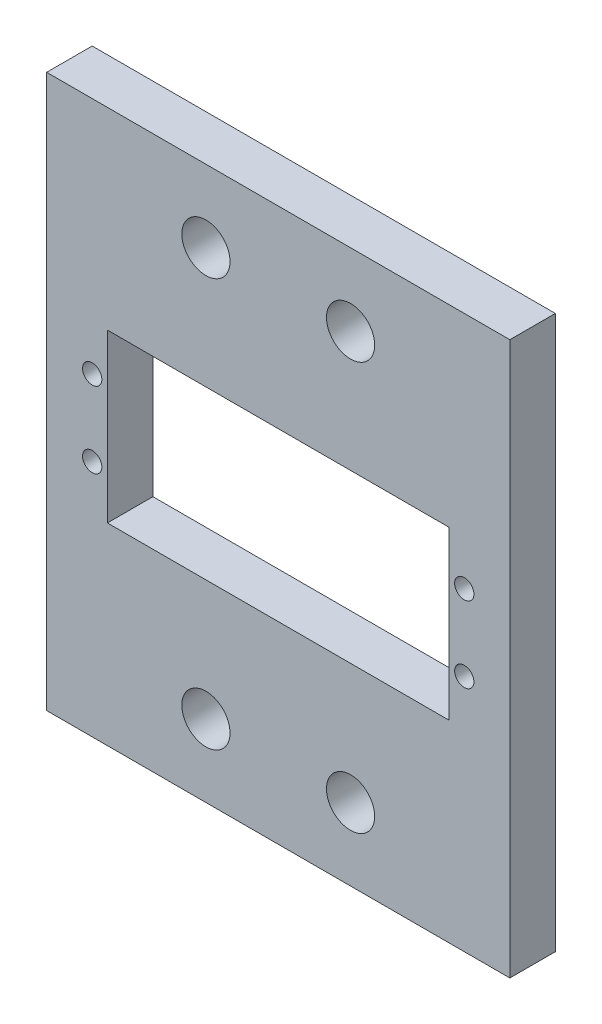
ISO-10303-21;
HEADER;
FILE_DESCRIPTION(('STEP AP214'),'2;1');
FILE_NAME('part.step','',(''),(''),'','','');
FILE_SCHEMA(('AUTOMOTIVE_DESIGN { 1 0 10303 214 1 1 1 1 }'));
ENDSEC;
DATA;
#1=APPLICATION_CONTEXT('core data for automotive mechanical design processes');
#2=APPLICATION_PROTOCOL_DEFINITION('international standard','automotive_design',2000,#1);
#3=PRODUCT_CONTEXT('',#1,'mechanical');
#4=PRODUCT('Part','Part','',(#3));
#5=PRODUCT_RELATED_PRODUCT_CATEGORY('part','',(#4));
#6=PRODUCT_DEFINITION_FORMATION('','',#4);
#7=PRODUCT_DEFINITION_CONTEXT('part definition',#1,'design');
#8=PRODUCT_DEFINITION('design','',#6,#7);
#9=PRODUCT_DEFINITION_SHAPE('','',#8);
#10=(LENGTH_UNIT() NAMED_UNIT(*) SI_UNIT(.MILLI.,.METRE.));
#11=(NAMED_UNIT(*) PLANE_ANGLE_UNIT() SI_UNIT($,.RADIAN.));
#12=(NAMED_UNIT(*) SI_UNIT($,.STERADIAN.) SOLID_ANGLE_UNIT());
#13=UNCERTAINTY_MEASURE_WITH_UNIT(LENGTH_MEASURE(1.E-05),#10,'distance_accuracy_value','');
#14=(GEOMETRIC_REPRESENTATION_CONTEXT(3) GLOBAL_UNCERTAINTY_ASSIGNED_CONTEXT((#13)) GLOBAL_UNIT_ASSIGNED_CONTEXT((#10,
#11,#12)) REPRESENTATION_CONTEXT('',''));
#15=CARTESIAN_POINT('',(0.,0.,0.));
#16=DIRECTION('',(0.,0.,1.));
#17=DIRECTION('',(1.,0.,0.));
#18=AXIS2_PLACEMENT_3D('',#15,#16,#17);
#19=CARTESIAN_POINT('',(0.,0.,5.9944));
#20=DIRECTION('',(0.,0.,1.));
#21=DIRECTION('',(1.,0.,0.));
#22=AXIS2_PLACEMENT_3D('',#19,#20,#21);
#23=PLANE('',#22);
#24=CARTESIAN_POINT('',(32.025,37.875,5.9944));
#25=DIRECTION('',(0.,0.,1.));
#26=DIRECTION('',(1.,0.,0.));
#27=AXIS2_PLACEMENT_3D('',#24,#25,#26);
#28=CIRCLE('',#27,3.175);
#29=CARTESIAN_POINT('',(35.2,37.875,5.9944));
#30=VERTEX_POINT('',#29);
#31=EDGE_CURVE('E261',#30,#30,#28,.T.);
#32=ORIENTED_EDGE('',*,*,#31,.F.);
#33=EDGE_LOOP('',(#32));
#34=FACE_BOUND('',#33,.T.);
#35=CARTESIAN_POINT('',(12.975,-15.875,5.9944));
#36=DIRECTION('',(0.,0.,1.));
#37=DIRECTION('',(1.,0.,0.));
#38=AXIS2_PLACEMENT_3D('',#35,#36,#37);
#39=CIRCLE('',#38,3.17500000000001);
#40=CARTESIAN_POINT('',(16.15,-15.875,5.9944));
#41=VERTEX_POINT('',#40);
#42=EDGE_CURVE('E273',#41,#41,#39,.T.);
#43=ORIENTED_EDGE('',*,*,#42,.F.);
#44=EDGE_LOOP('',(#43));
#45=FACE_BOUND('',#44,.T.);
#46=CARTESIAN_POINT('',(47.,16.,5.9944));
#47=DIRECTION('',(0.,0.,1.));
#48=DIRECTION('',(1.,0.,0.));
#49=AXIS2_PLACEMENT_3D('',#46,#47,#48);
#50=CIRCLE('',#49,1.27);
#51=CARTESIAN_POINT('',(48.27,16.,5.9944));
#52=VERTEX_POINT('',#51);
#53=EDGE_CURVE('E285',#52,#52,#50,.T.);
#54=ORIENTED_EDGE('',*,*,#53,.F.);
#55=EDGE_LOOP('',(#54));
#56=FACE_BOUND('',#55,.T.);
#57=CARTESIAN_POINT('',(-2.,16.,5.9944));
#58=DIRECTION('',(0.,0.,1.));
#59=DIRECTION('',(1.,0.,0.));
#60=AXIS2_PLACEMENT_3D('',#57,#58,#59);
#61=CIRCLE('',#60,1.27);
#62=CARTESIAN_POINT('',(-0.73,16.,5.9944));
#63=VERTEX_POINT('',#62);
#64=EDGE_CURVE('E126',#63,#63,#61,.T.);
#65=ORIENTED_EDGE('',*,*,#64,.F.);
#66=EDGE_LOOP('',(#65));
#67=FACE_BOUND('',#66,.T.);
#68=DIRECTION('',(0.,-1.,0.));
#69=VECTOR('',#68,1.);
#70=CARTESIAN_POINT('',(-8.,47.4,5.9944));
#71=LINE('',#70,#69);
#72=CARTESIAN_POINT('',(-8.,47.4,5.9944));
#73=VERTEX_POINT('',#72);
#74=CARTESIAN_POINT('',(-7.99999999999999,-25.4,5.9944));
#75=VERTEX_POINT('',#74);
#76=EDGE_CURVE('E136',#73,#75,#71,.T.);
#77=ORIENTED_EDGE('',*,*,#76,.T.);
#78=DIRECTION('',(1.,0.,0.));
#79=VECTOR('',#78,1.);
#80=CARTESIAN_POINT('',(-7.99999999999999,-25.4,5.9944));
#81=LINE('',#80,#79);
#82=CARTESIAN_POINT('',(53.,-25.4,5.9944));
#83=VERTEX_POINT('',#82);
#84=EDGE_CURVE('E139',#75,#83,#81,.T.);
#85=ORIENTED_EDGE('',*,*,#84,.T.);
#86=DIRECTION('',(0.,1.,0.));
#87=VECTOR('',#86,1.);
#88=CARTESIAN_POINT('',(53.,47.4,5.9944));
#89=LINE('',#88,#87);
#90=CARTESIAN_POINT('',(53.,47.4,5.9944));
#91=VERTEX_POINT('',#90);
#92=EDGE_CURVE('E142',#83,#91,#89,.T.);
#93=ORIENTED_EDGE('',*,*,#92,.T.);
#94=DIRECTION('',(-1.,0.,0.));
#95=VECTOR('',#94,1.);
#96=CARTESIAN_POINT('',(-8.,47.4,5.9944));
#97=LINE('',#96,#95);
#98=EDGE_CURVE('E144',#91,#73,#97,.T.);
#99=ORIENTED_EDGE('',*,*,#98,.T.);
#100=EDGE_LOOP('',(#77,#85,#93,#99));
#101=FACE_BOUND('',#100,.T.);
#102=DIRECTION('',(1.,0.,0.));
#103=VECTOR('',#102,1.);
#104=CARTESIAN_POINT('',(0.,0.,5.9944));
#105=LINE('',#104,#103);
#106=CARTESIAN_POINT('',(0.,0.,5.9944));
#107=VERTEX_POINT('',#106);
#108=CARTESIAN_POINT('',(45.,0.,5.9944));
#109=VERTEX_POINT('',#108);
#110=EDGE_CURVE('E105',#107,#109,#105,.T.);
#111=ORIENTED_EDGE('',*,*,#110,.F.);
#112=DIRECTION('',(0.,-1.,0.));
#113=VECTOR('',#112,1.);
#114=CARTESIAN_POINT('',(0.,0.,5.9944));
#115=LINE('',#114,#113);
#116=CARTESIAN_POINT('',(0.,22.,5.9944));
#117=VERTEX_POINT('',#116);
#118=EDGE_CURVE('E97',#117,#107,#115,.T.);
#119=ORIENTED_EDGE('',*,*,#118,.F.);
#120=DIRECTION('',(-1.,0.,0.));
#121=VECTOR('',#120,1.);
#122=CARTESIAN_POINT('',(0.,22.,5.9944));
#123=LINE('',#122,#121);
#124=CARTESIAN_POINT('',(45.,22.,5.9944));
#125=VERTEX_POINT('',#124);
#126=EDGE_CURVE('E120',#125,#117,#123,.T.);
#127=ORIENTED_EDGE('',*,*,#126,.F.);
#128=DIRECTION('',(0.,1.,0.));
#129=VECTOR('',#128,1.);
#130=CARTESIAN_POINT('',(45.,0.,5.9944));
#131=LINE('',#130,#129);
#132=EDGE_CURVE('E118',#109,#125,#131,.T.);
#133=ORIENTED_EDGE('',*,*,#132,.F.);
#134=EDGE_LOOP('',(#111,#119,#127,#133));
#135=FACE_BOUND('',#134,.T.);
#136=CARTESIAN_POINT('',(-2.,6.,5.9944));
#137=DIRECTION('',(0.,0.,1.));
#138=DIRECTION('',(1.,0.,0.));
#139=AXIS2_PLACEMENT_3D('',#136,#137,#138);
#140=CIRCLE('',#139,1.27);
#141=CARTESIAN_POINT('',(-0.730000000000002,6.,5.9944));
#142=VERTEX_POINT('',#141);
#143=EDGE_CURVE('E291',#142,#142,#140,.T.);
#144=ORIENTED_EDGE('',*,*,#143,.F.);
#145=EDGE_LOOP('',(#144));
#146=FACE_BOUND('',#145,.T.);
#147=CARTESIAN_POINT('',(47.,6.,5.9944));
#148=DIRECTION('',(0.,0.,1.));
#149=DIRECTION('',(1.,0.,0.));
#150=AXIS2_PLACEMENT_3D('',#147,#148,#149);
#151=CIRCLE('',#150,1.27);
#152=CARTESIAN_POINT('',(48.27,6.,5.9944));
#153=VERTEX_POINT('',#152);
#154=EDGE_CURVE('E279',#153,#153,#151,.T.);
#155=ORIENTED_EDGE('',*,*,#154,.F.);
#156=EDGE_LOOP('',(#155));
#157=FACE_BOUND('',#156,.T.);
#158=CARTESIAN_POINT('',(12.975,37.875,5.9944));
#159=DIRECTION('',(0.,0.,1.));
#160=DIRECTION('',(1.,0.,0.));
#161=AXIS2_PLACEMENT_3D('',#158,#159,#160);
#162=CIRCLE('',#161,3.175);
#163=CARTESIAN_POINT('',(16.15,37.875,5.9944));
#164=VERTEX_POINT('',#163);
#165=EDGE_CURVE('E267',#164,#164,#162,.T.);
#166=ORIENTED_EDGE('',*,*,#165,.F.);
#167=EDGE_LOOP('',(#166));
#168=FACE_BOUND('',#167,.T.);
#169=CARTESIAN_POINT('',(32.025,-15.875,5.9944));
#170=DIRECTION('',(0.,0.,1.));
#171=DIRECTION('',(1.,0.,0.));
#172=AXIS2_PLACEMENT_3D('',#169,#170,#171);
#173=CIRCLE('',#172,3.175);
#174=CARTESIAN_POINT('',(35.2,-15.875,5.9944));
#175=VERTEX_POINT('',#174);
#176=EDGE_CURVE('E252',#175,#175,#173,.T.);
#177=ORIENTED_EDGE('',*,*,#176,.F.);
#178=EDGE_LOOP('',(#177));
#179=FACE_BOUND('',#178,.T.);
#180=ADVANCED_FACE('F32',(#34,#45,#56,#67,#101,#135,#146,#157,#168,#179),#23,.T.);
#181=CARTESIAN_POINT('',(0.,0.,0.));
#182=DIRECTION('',(0.,0.,1.));
#183=DIRECTION('',(1.,0.,0.));
#184=AXIS2_PLACEMENT_3D('',#181,#182,#183);
#185=PLANE('',#184);
#186=CARTESIAN_POINT('',(32.025,37.875,0.));
#187=DIRECTION('',(0.,0.,1.));
#188=DIRECTION('',(1.,0.,0.));
#189=AXIS2_PLACEMENT_3D('',#186,#187,#188);
#190=CIRCLE('',#189,3.175);
#191=CARTESIAN_POINT('',(35.2,37.875,0.));
#192=VERTEX_POINT('',#191);
#193=EDGE_CURVE('E258',#192,#192,#190,.T.);
#194=ORIENTED_EDGE('',*,*,#193,.T.);
#195=EDGE_LOOP('',(#194));
#196=FACE_BOUND('',#195,.T.);
#197=CARTESIAN_POINT('',(12.975,-15.875,0.));
#198=DIRECTION('',(0.,0.,1.));
#199=DIRECTION('',(1.,0.,0.));
#200=AXIS2_PLACEMENT_3D('',#197,#198,#199);
#201=CIRCLE('',#200,3.17500000000001);
#202=CARTESIAN_POINT('',(16.15,-15.875,0.));
#203=VERTEX_POINT('',#202);
#204=EDGE_CURVE('E270',#203,#203,#201,.T.);
#205=ORIENTED_EDGE('',*,*,#204,.T.);
#206=EDGE_LOOP('',(#205));
#207=FACE_BOUND('',#206,.T.);
#208=CARTESIAN_POINT('',(47.,16.,0.));
#209=DIRECTION('',(0.,0.,1.));
#210=DIRECTION('',(1.,0.,0.));
#211=AXIS2_PLACEMENT_3D('',#208,#209,#210);
#212=CIRCLE('',#211,1.27);
#213=CARTESIAN_POINT('',(48.27,16.,0.));
#214=VERTEX_POINT('',#213);
#215=EDGE_CURVE('E282',#214,#214,#212,.T.);
#216=ORIENTED_EDGE('',*,*,#215,.T.);
#217=EDGE_LOOP('',(#216));
#218=FACE_BOUND('',#217,.T.);
#219=CARTESIAN_POINT('',(-2.,16.,0.));
#220=DIRECTION('',(0.,0.,1.));
#221=DIRECTION('',(1.,0.,0.));
#222=AXIS2_PLACEMENT_3D('',#219,#220,#221);
#223=CIRCLE('',#222,1.27);
#224=CARTESIAN_POINT('',(-0.73,16.,0.));
#225=VERTEX_POINT('',#224);
#226=EDGE_CURVE('E294',#225,#225,#223,.T.);
#227=ORIENTED_EDGE('',*,*,#226,.T.);
#228=EDGE_LOOP('',(#227));
#229=FACE_BOUND('',#228,.T.);
#230=DIRECTION('',(0.,-1.,0.));
#231=VECTOR('',#230,1.);
#232=CARTESIAN_POINT('',(-8.,47.4,0.));
#233=LINE('',#232,#231);
#234=CARTESIAN_POINT('',(-8.,47.4,0.));
#235=VERTEX_POINT('',#234);
#236=CARTESIAN_POINT('',(-7.99999999999999,-25.4,0.));
#237=VERTEX_POINT('',#236);
#238=EDGE_CURVE('E113',#235,#237,#233,.T.);
#239=ORIENTED_EDGE('',*,*,#238,.F.);
#240=DIRECTION('',(-1.,0.,0.));
#241=VECTOR('',#240,1.);
#242=CARTESIAN_POINT('',(-8.,47.4,0.));
#243=LINE('',#242,#241);
#244=CARTESIAN_POINT('',(53.,47.4,0.));
#245=VERTEX_POINT('',#244);
#246=EDGE_CURVE('E140',#245,#235,#243,.T.);
#247=ORIENTED_EDGE('',*,*,#246,.F.);
#248=DIRECTION('',(0.,1.,0.));
#249=VECTOR('',#248,1.);
#250=CARTESIAN_POINT('',(53.,47.4,0.));
#251=LINE('',#250,#249);
#252=CARTESIAN_POINT('',(53.,-25.4,0.));
#253=VERTEX_POINT('',#252);
#254=EDGE_CURVE('E151',#253,#245,#251,.T.);
#255=ORIENTED_EDGE('',*,*,#254,.F.);
#256=DIRECTION('',(1.,0.,0.));
#257=VECTOR('',#256,1.);
#258=CARTESIAN_POINT('',(-7.99999999999999,-25.4,0.));
#259=LINE('',#258,#257);
#260=EDGE_CURVE('E149',#237,#253,#259,.T.);
#261=ORIENTED_EDGE('',*,*,#260,.F.);
#262=EDGE_LOOP('',(#239,#247,#255,#261));
#263=FACE_BOUND('',#262,.T.);
#264=DIRECTION('',(0.,-1.,0.));
#265=VECTOR('',#264,1.);
#266=CARTESIAN_POINT('',(0.,0.,0.));
#267=LINE('',#266,#265);
#268=CARTESIAN_POINT('',(0.,22.,0.));
#269=VERTEX_POINT('',#268);
#270=CARTESIAN_POINT('',(0.,0.,0.));
#271=VERTEX_POINT('',#270);
#272=EDGE_CURVE('E55',#269,#271,#267,.T.);
#273=ORIENTED_EDGE('',*,*,#272,.T.);
#274=DIRECTION('',(1.,0.,0.));
#275=VECTOR('',#274,1.);
#276=CARTESIAN_POINT('',(0.,0.,0.));
#277=LINE('',#276,#275);
#278=CARTESIAN_POINT('',(45.,0.,0.));
#279=VERTEX_POINT('',#278);
#280=EDGE_CURVE('E112',#271,#279,#277,.T.);
#281=ORIENTED_EDGE('',*,*,#280,.T.);
#282=DIRECTION('',(0.,1.,0.));
#283=VECTOR('',#282,1.);
#284=CARTESIAN_POINT('',(45.,0.,0.));
#285=LINE('',#284,#283);
#286=CARTESIAN_POINT('',(45.,22.,0.));
#287=VERTEX_POINT('',#286);
#288=EDGE_CURVE('E128',#279,#287,#285,.T.);
#289=ORIENTED_EDGE('',*,*,#288,.T.);
#290=DIRECTION('',(-1.,0.,0.));
#291=VECTOR('',#290,1.);
#292=CARTESIAN_POINT('',(0.,22.,0.));
#293=LINE('',#292,#291);
#294=EDGE_CURVE('E106',#287,#269,#293,.T.);
#295=ORIENTED_EDGE('',*,*,#294,.T.);
#296=EDGE_LOOP('',(#273,#281,#289,#295));
#297=FACE_BOUND('',#296,.T.);
#298=CARTESIAN_POINT('',(-2.,6.,0.));
#299=DIRECTION('',(0.,0.,1.));
#300=DIRECTION('',(1.,0.,0.));
#301=AXIS2_PLACEMENT_3D('',#298,#299,#300);
#302=CIRCLE('',#301,1.27);
#303=CARTESIAN_POINT('',(-0.730000000000002,6.,0.));
#304=VERTEX_POINT('',#303);
#305=EDGE_CURVE('E288',#304,#304,#302,.T.);
#306=ORIENTED_EDGE('',*,*,#305,.T.);
#307=EDGE_LOOP('',(#306));
#308=FACE_BOUND('',#307,.T.);
#309=CARTESIAN_POINT('',(47.,6.,0.));
#310=DIRECTION('',(0.,0.,1.));
#311=DIRECTION('',(1.,0.,0.));
#312=AXIS2_PLACEMENT_3D('',#309,#310,#311);
#313=CIRCLE('',#312,1.27);
#314=CARTESIAN_POINT('',(48.27,6.,0.));
#315=VERTEX_POINT('',#314);
#316=EDGE_CURVE('E276',#315,#315,#313,.T.);
#317=ORIENTED_EDGE('',*,*,#316,.T.);
#318=EDGE_LOOP('',(#317));
#319=FACE_BOUND('',#318,.T.);
#320=CARTESIAN_POINT('',(12.975,37.875,0.));
#321=DIRECTION('',(0.,0.,1.));
#322=DIRECTION('',(1.,0.,0.));
#323=AXIS2_PLACEMENT_3D('',#320,#321,#322);
#324=CIRCLE('',#323,3.175);
#325=CARTESIAN_POINT('',(16.15,37.875,0.));
#326=VERTEX_POINT('',#325);
#327=EDGE_CURVE('E264',#326,#326,#324,.T.);
#328=ORIENTED_EDGE('',*,*,#327,.T.);
#329=EDGE_LOOP('',(#328));
#330=FACE_BOUND('',#329,.T.);
#331=CARTESIAN_POINT('',(32.025,-15.875,0.));
#332=DIRECTION('',(0.,0.,1.));
#333=DIRECTION('',(1.,0.,0.));
#334=AXIS2_PLACEMENT_3D('',#331,#332,#333);
#335=CIRCLE('',#334,3.175);
#336=CARTESIAN_POINT('',(35.2,-15.875,0.));
#337=VERTEX_POINT('',#336);
#338=EDGE_CURVE('E255',#337,#337,#335,.T.);
#339=ORIENTED_EDGE('',*,*,#338,.T.);
#340=EDGE_LOOP('',(#339));
#341=FACE_BOUND('',#340,.T.);
#342=ADVANCED_FACE('F169',(#196,#207,#218,#229,#263,#297,#308,#319,#330,#341),#185,.F.);
#343=CARTESIAN_POINT('',(-8.,47.4,5.9944));
#344=DIRECTION('',(1.,0.,0.));
#345=DIRECTION('',(0.,1.,0.));
#346=AXIS2_PLACEMENT_3D('',#343,#344,#345);
#347=PLANE('',#346);
#348=ORIENTED_EDGE('',*,*,#238,.T.);
#349=DIRECTION('',(0.,0.,-1.));
#350=VECTOR('',#349,1.);
#351=CARTESIAN_POINT('',(-7.99999999999999,-25.4,5.9944));
#352=LINE('',#351,#350);
#353=EDGE_CURVE('E11',#75,#237,#352,.T.);
#354=ORIENTED_EDGE('',*,*,#353,.F.);
#355=ORIENTED_EDGE('',*,*,#76,.F.);
#356=DIRECTION('',(0.,0.,-1.));
#357=VECTOR('',#356,1.);
#358=CARTESIAN_POINT('',(-8.,47.4,5.9944));
#359=LINE('',#358,#357);
#360=EDGE_CURVE('E146',#73,#235,#359,.T.);
#361=ORIENTED_EDGE('',*,*,#360,.T.);
#362=EDGE_LOOP('',(#348,#354,#355,#361));
#363=FACE_BOUND('',#362,.T.);
#364=ADVANCED_FACE('F34',(#363),#347,.F.);
#365=CARTESIAN_POINT('',(-7.99999999999999,-25.4,5.9944));
#366=DIRECTION('',(0.,1.,0.));
#367=DIRECTION('',(0.,0.,1.));
#368=AXIS2_PLACEMENT_3D('',#365,#366,#367);
#369=PLANE('',#368);
#370=ORIENTED_EDGE('',*,*,#260,.T.);
#371=DIRECTION('',(0.,0.,-1.));
#372=VECTOR('',#371,1.);
#373=CARTESIAN_POINT('',(53.,-25.4,5.9944));
#374=LINE('',#373,#372);
#375=EDGE_CURVE('E40',#83,#253,#374,.T.);
#376=ORIENTED_EDGE('',*,*,#375,.F.);
#377=ORIENTED_EDGE('',*,*,#84,.F.);
#378=ORIENTED_EDGE('',*,*,#353,.T.);
#379=EDGE_LOOP('',(#370,#376,#377,#378));
#380=FACE_BOUND('',#379,.T.);
#381=ADVANCED_FACE('F179',(#380),#369,.F.);
#382=CARTESIAN_POINT('',(53.,47.4,5.9944));
#383=DIRECTION('',(-1.,0.,0.));
#384=DIRECTION('',(0.,-1.,0.));
#385=AXIS2_PLACEMENT_3D('',#382,#383,#384);
#386=PLANE('',#385);
#387=ORIENTED_EDGE('',*,*,#254,.T.);
#388=DIRECTION('',(0.,0.,-1.));
#389=VECTOR('',#388,1.);
#390=CARTESIAN_POINT('',(53.,47.4,5.9944));
#391=LINE('',#390,#389);
#392=EDGE_CURVE('E156',#91,#245,#391,.T.);
#393=ORIENTED_EDGE('',*,*,#392,.F.);
#394=ORIENTED_EDGE('',*,*,#92,.F.);
#395=ORIENTED_EDGE('',*,*,#375,.T.);
#396=EDGE_LOOP('',(#387,#393,#394,#395));
#397=FACE_BOUND('',#396,.T.);
#398=ADVANCED_FACE('F163',(#397),#386,.F.);
#399=CARTESIAN_POINT('',(-8.,47.4,5.9944));
#400=DIRECTION('',(0.,-1.,0.));
#401=DIRECTION('',(0.,0.,-1.));
#402=AXIS2_PLACEMENT_3D('',#399,#400,#401);
#403=PLANE('',#402);
#404=ORIENTED_EDGE('',*,*,#246,.T.);
#405=ORIENTED_EDGE('',*,*,#360,.F.);
#406=ORIENTED_EDGE('',*,*,#98,.F.);
#407=ORIENTED_EDGE('',*,*,#392,.T.);
#408=EDGE_LOOP('',(#404,#405,#406,#407));
#409=FACE_BOUND('',#408,.T.);
#410=ADVANCED_FACE('F173',(#409),#403,.F.);
#411=CARTESIAN_POINT('',(0.,0.,5.9944));
#412=DIRECTION('',(1.,0.,0.));
#413=DIRECTION('',(0.,0.,-1.));
#414=AXIS2_PLACEMENT_3D('',#411,#412,#413);
#415=PLANE('',#414);
#416=ORIENTED_EDGE('',*,*,#272,.F.);
#417=DIRECTION('',(0.,0.,-1.));
#418=VECTOR('',#417,1.);
#419=CARTESIAN_POINT('',(0.,22.,5.9944));
#420=LINE('',#419,#418);
#421=EDGE_CURVE('E101',#117,#269,#420,.T.);
#422=ORIENTED_EDGE('',*,*,#421,.F.);
#423=ORIENTED_EDGE('',*,*,#118,.T.);
#424=DIRECTION('',(0.,0.,-1.));
#425=VECTOR('',#424,1.);
#426=CARTESIAN_POINT('',(0.,0.,5.9944));
#427=LINE('',#426,#425);
#428=EDGE_CURVE('E100',#107,#271,#427,.T.);
#429=ORIENTED_EDGE('',*,*,#428,.T.);
#430=EDGE_LOOP('',(#416,#422,#423,#429));
#431=FACE_BOUND('',#430,.T.);
#432=ADVANCED_FACE('F99',(#431),#415,.T.);
#433=CARTESIAN_POINT('',(0.,0.,5.9944));
#434=DIRECTION('',(0.,1.,0.));
#435=DIRECTION('',(0.,0.,1.));
#436=AXIS2_PLACEMENT_3D('',#433,#434,#435);
#437=PLANE('',#436);
#438=ORIENTED_EDGE('',*,*,#280,.F.);
#439=ORIENTED_EDGE('',*,*,#428,.F.);
#440=ORIENTED_EDGE('',*,*,#110,.T.);
#441=DIRECTION('',(0.,0.,-1.));
#442=VECTOR('',#441,1.);
#443=CARTESIAN_POINT('',(45.,0.,5.9944));
#444=LINE('',#443,#442);
#445=EDGE_CURVE('E114',#109,#279,#444,.T.);
#446=ORIENTED_EDGE('',*,*,#445,.T.);
#447=EDGE_LOOP('',(#438,#439,#440,#446));
#448=FACE_BOUND('',#447,.T.);
#449=ADVANCED_FACE('F109',(#448),#437,.T.);
#450=CARTESIAN_POINT('',(45.,0.,5.9944));
#451=DIRECTION('',(-1.,0.,0.));
#452=DIRECTION('',(0.,0.,1.));
#453=AXIS2_PLACEMENT_3D('',#450,#451,#452);
#454=PLANE('',#453);
#455=ORIENTED_EDGE('',*,*,#288,.F.);
#456=ORIENTED_EDGE('',*,*,#445,.F.);
#457=ORIENTED_EDGE('',*,*,#132,.T.);
#458=DIRECTION('',(0.,0.,-1.));
#459=VECTOR('',#458,1.);
#460=CARTESIAN_POINT('',(45.,22.,5.9944));
#461=LINE('',#460,#459);
#462=EDGE_CURVE('E47',#125,#287,#461,.T.);
#463=ORIENTED_EDGE('',*,*,#462,.T.);
#464=EDGE_LOOP('',(#455,#456,#457,#463));
#465=FACE_BOUND('',#464,.T.);
#466=ADVANCED_FACE('F206',(#465),#454,.T.);
#467=CARTESIAN_POINT('',(0.,22.,5.9944));
#468=DIRECTION('',(0.,-1.,0.));
#469=DIRECTION('',(0.,0.,-1.));
#470=AXIS2_PLACEMENT_3D('',#467,#468,#469);
#471=PLANE('',#470);
#472=ORIENTED_EDGE('',*,*,#294,.F.);
#473=ORIENTED_EDGE('',*,*,#462,.F.);
#474=ORIENTED_EDGE('',*,*,#126,.T.);
#475=ORIENTED_EDGE('',*,*,#421,.T.);
#476=EDGE_LOOP('',(#472,#473,#474,#475));
#477=FACE_BOUND('',#476,.T.);
#478=ADVANCED_FACE('F210',(#477),#471,.T.);
#479=CARTESIAN_POINT('',(-2.,16.,5.9944));
#480=DIRECTION('',(0.,0.,-1.));
#481=DIRECTION('',(-1.,0.,0.));
#482=AXIS2_PLACEMENT_3D('',#479,#480,#481);
#483=CYLINDRICAL_SURFACE('',#482,1.27);
#484=ORIENTED_EDGE('',*,*,#64,.T.);
#485=EDGE_LOOP('',(#484));
#486=FACE_BOUND('',#485,.T.);
#487=ORIENTED_EDGE('',*,*,#226,.F.);
#488=EDGE_LOOP('',(#487));
#489=FACE_BOUND('',#488,.T.);
#490=ADVANCED_FACE('F216',(#486,#489),#483,.F.);
#491=CARTESIAN_POINT('',(-2.,6.,5.9944));
#492=DIRECTION('',(0.,0.,-1.));
#493=DIRECTION('',(-1.,0.,0.));
#494=AXIS2_PLACEMENT_3D('',#491,#492,#493);
#495=CYLINDRICAL_SURFACE('',#494,1.27);
#496=ORIENTED_EDGE('',*,*,#143,.T.);
#497=EDGE_LOOP('',(#496));
#498=FACE_BOUND('',#497,.T.);
#499=ORIENTED_EDGE('',*,*,#305,.F.);
#500=EDGE_LOOP('',(#499));
#501=FACE_BOUND('',#500,.T.);
#502=ADVANCED_FACE('F219',(#498,#501),#495,.F.);
#503=CARTESIAN_POINT('',(47.,16.,5.9944));
#504=DIRECTION('',(0.,0.,-1.));
#505=DIRECTION('',(-1.,0.,0.));
#506=AXIS2_PLACEMENT_3D('',#503,#504,#505);
#507=CYLINDRICAL_SURFACE('',#506,1.27);
#508=ORIENTED_EDGE('',*,*,#53,.T.);
#509=EDGE_LOOP('',(#508));
#510=FACE_BOUND('',#509,.T.);
#511=ORIENTED_EDGE('',*,*,#215,.F.);
#512=EDGE_LOOP('',(#511));
#513=FACE_BOUND('',#512,.T.);
#514=ADVANCED_FACE('F223',(#510,#513),#507,.F.);
#515=CARTESIAN_POINT('',(47.,6.,5.9944));
#516=DIRECTION('',(0.,0.,-1.));
#517=DIRECTION('',(-1.,0.,0.));
#518=AXIS2_PLACEMENT_3D('',#515,#516,#517);
#519=CYLINDRICAL_SURFACE('',#518,1.27);
#520=ORIENTED_EDGE('',*,*,#154,.T.);
#521=EDGE_LOOP('',(#520));
#522=FACE_BOUND('',#521,.T.);
#523=ORIENTED_EDGE('',*,*,#316,.F.);
#524=EDGE_LOOP('',(#523));
#525=FACE_BOUND('',#524,.T.);
#526=ADVANCED_FACE('F227',(#522,#525),#519,.F.);
#527=CARTESIAN_POINT('',(12.975,-15.875,5.9944));
#528=DIRECTION('',(0.,0.,-1.));
#529=DIRECTION('',(-1.,0.,0.));
#530=AXIS2_PLACEMENT_3D('',#527,#528,#529);
#531=CYLINDRICAL_SURFACE('',#530,3.17500000000001);
#532=ORIENTED_EDGE('',*,*,#42,.T.);
#533=EDGE_LOOP('',(#532));
#534=FACE_BOUND('',#533,.T.);
#535=ORIENTED_EDGE('',*,*,#204,.F.);
#536=EDGE_LOOP('',(#535));
#537=FACE_BOUND('',#536,.T.);
#538=ADVANCED_FACE('F231',(#534,#537),#531,.F.);
#539=CARTESIAN_POINT('',(12.975,37.875,5.9944));
#540=DIRECTION('',(0.,0.,-1.));
#541=DIRECTION('',(-1.,0.,0.));
#542=AXIS2_PLACEMENT_3D('',#539,#540,#541);
#543=CYLINDRICAL_SURFACE('',#542,3.175);
#544=ORIENTED_EDGE('',*,*,#165,.T.);
#545=EDGE_LOOP('',(#544));
#546=FACE_BOUND('',#545,.T.);
#547=ORIENTED_EDGE('',*,*,#327,.F.);
#548=EDGE_LOOP('',(#547));
#549=FACE_BOUND('',#548,.T.);
#550=ADVANCED_FACE('F235',(#546,#549),#543,.F.);
#551=CARTESIAN_POINT('',(32.025,37.875,5.9944));
#552=DIRECTION('',(0.,0.,-1.));
#553=DIRECTION('',(-1.,0.,0.));
#554=AXIS2_PLACEMENT_3D('',#551,#552,#553);
#555=CYLINDRICAL_SURFACE('',#554,3.175);
#556=ORIENTED_EDGE('',*,*,#31,.T.);
#557=EDGE_LOOP('',(#556));
#558=FACE_BOUND('',#557,.T.);
#559=ORIENTED_EDGE('',*,*,#193,.F.);
#560=EDGE_LOOP('',(#559));
#561=FACE_BOUND('',#560,.T.);
#562=ADVANCED_FACE('F239',(#558,#561),#555,.F.);
#563=CARTESIAN_POINT('',(32.025,-15.875,5.9944));
#564=DIRECTION('',(0.,0.,-1.));
#565=DIRECTION('',(-1.,0.,0.));
#566=AXIS2_PLACEMENT_3D('',#563,#564,#565);
#567=CYLINDRICAL_SURFACE('',#566,3.175);
#568=ORIENTED_EDGE('',*,*,#176,.T.);
#569=EDGE_LOOP('',(#568));
#570=FACE_BOUND('',#569,.T.);
#571=ORIENTED_EDGE('',*,*,#338,.F.);
#572=EDGE_LOOP('',(#571));
#573=FACE_BOUND('',#572,.T.);
#574=ADVANCED_FACE('F243',(#570,#573),#567,.F.);
#575=CLOSED_SHELL('',(#180,#342,#364,#381,#398,#410,#432,#449,#466,#478,#490,#502,#514,#526,
#538,#550,#562,#574));
#576=MANIFOLD_SOLID_BREP('B2',#575);
#577=ADVANCED_BREP_SHAPE_REPRESENTATION('',(#18,#576),#14);
#578=SHAPE_DEFINITION_REPRESENTATION(#9,#577);
ENDSEC;
END-ISO-10303-21;
